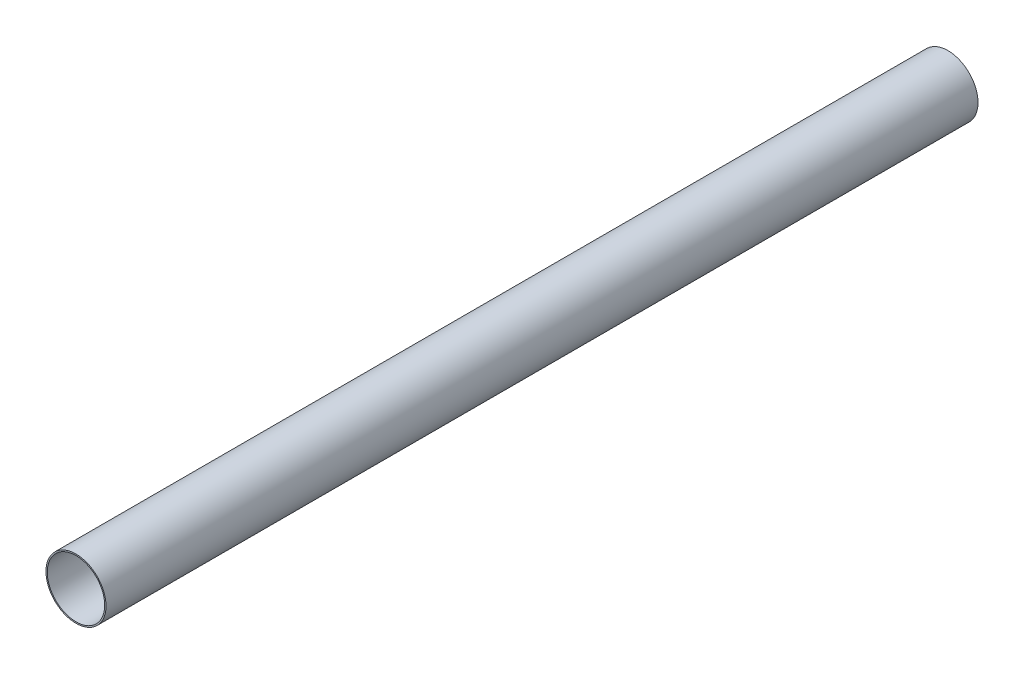
ISO-10303-21;
HEADER;
FILE_DESCRIPTION(('STEP AP214'),'2;1');
FILE_NAME('part.step','',(''),(''),'','','');
FILE_SCHEMA(('AUTOMOTIVE_DESIGN { 1 0 10303 214 1 1 1 1 }'));
ENDSEC;
DATA;
#1=APPLICATION_CONTEXT('core data for automotive mechanical design processes');
#2=APPLICATION_PROTOCOL_DEFINITION('international standard','automotive_design',2000,#1);
#3=PRODUCT_CONTEXT('',#1,'mechanical');
#4=PRODUCT('Part','Part','',(#3));
#5=PRODUCT_RELATED_PRODUCT_CATEGORY('part','',(#4));
#6=PRODUCT_DEFINITION_FORMATION('','',#4);
#7=PRODUCT_DEFINITION_CONTEXT('part definition',#1,'design');
#8=PRODUCT_DEFINITION('design','',#6,#7);
#9=PRODUCT_DEFINITION_SHAPE('','',#8);
#10=(LENGTH_UNIT() NAMED_UNIT(*) SI_UNIT(.MILLI.,.METRE.));
#11=(NAMED_UNIT(*) PLANE_ANGLE_UNIT() SI_UNIT($,.RADIAN.));
#12=(NAMED_UNIT(*) SI_UNIT($,.STERADIAN.) SOLID_ANGLE_UNIT());
#13=UNCERTAINTY_MEASURE_WITH_UNIT(LENGTH_MEASURE(1.E-05),#10,'distance_accuracy_value','');
#14=(GEOMETRIC_REPRESENTATION_CONTEXT(3) GLOBAL_UNCERTAINTY_ASSIGNED_CONTEXT((#13)) GLOBAL_UNIT_ASSIGNED_CONTEXT((#10,
#11,#12)) REPRESENTATION_CONTEXT('',''));
#15=CARTESIAN_POINT('',(0.,0.,0.));
#16=DIRECTION('',(0.,0.,1.));
#17=DIRECTION('',(1.,0.,0.));
#18=AXIS2_PLACEMENT_3D('',#15,#16,#17);
#19=CARTESIAN_POINT('',(0.,0.,460.));
#20=DIRECTION('',(0.,0.,-1.));
#21=DIRECTION('',(-1.,0.,0.));
#22=AXIS2_PLACEMENT_3D('',#19,#20,#21);
#23=CYLINDRICAL_SURFACE('',#22,15.15);
#24=CARTESIAN_POINT('',(0.,0.,460.));
#25=DIRECTION('',(0.,0.,1.));
#26=DIRECTION('',(1.,0.,0.));
#27=AXIS2_PLACEMENT_3D('',#24,#25,#26);
#28=CIRCLE('',#27,15.15);
#29=CARTESIAN_POINT('',(15.15,0.,460.));
#30=VERTEX_POINT('',#29);
#31=EDGE_CURVE('E93',#30,#30,#28,.T.);
#32=ORIENTED_EDGE('',*,*,#31,.T.);
#33=EDGE_LOOP('',(#32));
#34=FACE_BOUND('',#33,.T.);
#35=CARTESIAN_POINT('',(0.,0.,425.));
#36=DIRECTION('',(0.,0.,1.));
#37=DIRECTION('',(1.,0.,0.));
#38=AXIS2_PLACEMENT_3D('',#35,#36,#37);
#39=CIRCLE('',#38,15.15);
#40=CARTESIAN_POINT('',(15.15,0.,425.));
#41=VERTEX_POINT('',#40);
#42=EDGE_CURVE('E144',#41,#41,#39,.T.);
#43=ORIENTED_EDGE('',*,*,#42,.F.);
#44=EDGE_LOOP('',(#43));
#45=FACE_BOUND('',#44,.T.);
#46=ADVANCED_FACE('F78',(#34,#45),#23,.F.);
#47=CARTESIAN_POINT('',(0.,0.,0.));
#48=DIRECTION('',(0.,0.,1.));
#49=DIRECTION('',(1.,0.,0.));
#50=AXIS2_PLACEMENT_3D('',#47,#48,#49);
#51=CIRCLE('',#50,15.15);
#52=CARTESIAN_POINT('',(15.15,0.,0.));
#53=VERTEX_POINT('',#52);
#54=EDGE_CURVE('E96',#53,#53,#51,.T.);
#55=ORIENTED_EDGE('',*,*,#54,.F.);
#56=EDGE_LOOP('',(#55));
#57=FACE_BOUND('',#56,.T.);
#58=CARTESIAN_POINT('',(0.,0.,65.));
#59=DIRECTION('',(0.,0.,1.));
#60=DIRECTION('',(1.,0.,0.));
#61=AXIS2_PLACEMENT_3D('',#58,#59,#60);
#62=CIRCLE('',#61,15.15);
#63=CARTESIAN_POINT('',(15.15,0.,65.));
#64=VERTEX_POINT('',#63);
#65=EDGE_CURVE('E103',#64,#64,#62,.T.);
#66=ORIENTED_EDGE('',*,*,#65,.T.);
#67=EDGE_LOOP('',(#66));
#68=FACE_BOUND('',#67,.T.);
#69=ADVANCED_FACE('F119',(#57,#68),#23,.F.);
#70=CARTESIAN_POINT('',(0.,0.,460.));
#71=DIRECTION('',(0.,0.,1.));
#72=DIRECTION('',(1.,0.,0.));
#73=AXIS2_PLACEMENT_3D('',#70,#71,#72);
#74=PLANE('',#73);
#75=CARTESIAN_POINT('',(0.,0.,460.));
#76=DIRECTION('',(0.,0.,1.));
#77=DIRECTION('',(1.,0.,0.));
#78=AXIS2_PLACEMENT_3D('',#75,#76,#77);
#79=CIRCLE('',#78,15.85);
#80=CARTESIAN_POINT('',(15.85,0.,460.));
#81=VERTEX_POINT('',#80);
#82=EDGE_CURVE('E12',#81,#81,#79,.T.);
#83=ORIENTED_EDGE('',*,*,#82,.T.);
#84=EDGE_LOOP('',(#83));
#85=FACE_BOUND('',#84,.T.);
#86=ORIENTED_EDGE('',*,*,#31,.F.);
#87=EDGE_LOOP('',(#86));
#88=FACE_BOUND('',#87,.T.);
#89=ADVANCED_FACE('F126',(#85,#88),#74,.T.);
#90=CARTESIAN_POINT('',(0.,0.,0.));
#91=DIRECTION('',(0.,0.,1.));
#92=DIRECTION('',(1.,0.,0.));
#93=AXIS2_PLACEMENT_3D('',#90,#91,#92);
#94=PLANE('',#93);
#95=CARTESIAN_POINT('',(0.,0.,0.));
#96=DIRECTION('',(0.,0.,1.));
#97=DIRECTION('',(1.,0.,0.));
#98=AXIS2_PLACEMENT_3D('',#95,#96,#97);
#99=CIRCLE('',#98,15.85);
#100=CARTESIAN_POINT('',(15.85,0.,0.));
#101=VERTEX_POINT('',#100);
#102=EDGE_CURVE('E88',#101,#101,#99,.T.);
#103=ORIENTED_EDGE('',*,*,#102,.F.);
#104=EDGE_LOOP('',(#103));
#105=FACE_BOUND('',#104,.T.);
#106=ORIENTED_EDGE('',*,*,#54,.T.);
#107=EDGE_LOOP('',(#106));
#108=FACE_BOUND('',#107,.T.);
#109=ADVANCED_FACE('F216',(#105,#108),#94,.F.);
#110=CARTESIAN_POINT('',(0.,0.,460.));
#111=DIRECTION('',(0.,0.,-1.));
#112=DIRECTION('',(-1.,0.,0.));
#113=AXIS2_PLACEMENT_3D('',#110,#111,#112);
#114=CYLINDRICAL_SURFACE('',#113,15.85);
#115=ORIENTED_EDGE('',*,*,#82,.F.);
#116=EDGE_LOOP('',(#115));
#117=FACE_BOUND('',#116,.T.);
#118=ORIENTED_EDGE('',*,*,#102,.T.);
#119=EDGE_LOOP('',(#118));
#120=FACE_BOUND('',#119,.T.);
#121=ADVANCED_FACE('F80',(#117,#120),#114,.T.);
#122=CARTESIAN_POINT('',(15.15,0.,65.));
#123=CARTESIAN_POINT('',(15.2166666666667,0.,78.3333333333334));
#124=CARTESIAN_POINT('',(15.2833333333333,0.,91.6666666666667));
#125=CARTESIAN_POINT('',(15.35,0.,105.));
#126=CARTESIAN_POINT('',(15.15,0.418075620016743,65.));
#127=CARTESIAN_POINT('',(15.2166666666667,0.419915336716487,78.3333333333334));
#128=CARTESIAN_POINT('',(15.2833333333333,0.421755053416231,91.6666666666667));
#129=CARTESIAN_POINT('',(15.35,0.423594770115975,105.));
#130=CARTESIAN_POINT('',(15.1160575620017,1.24636173604689,65.));
#131=CARTESIAN_POINT('',(15.182574867005,1.2518462761395,78.3333333333334));
#132=CARTESIAN_POINT('',(15.2490921720083,1.25733081623212,91.6666666666667));
#133=CARTESIAN_POINT('',(15.3156094770116,1.26281535632473,105.));
#134=CARTESIAN_POINT('',(14.9672281881085,2.46128394098282,65.));
#135=CARTESIAN_POINT('',(15.0330905783752,2.47211467339638,78.3333333333334));
#136=CARTESIAN_POINT('',(15.0989529686419,2.48294540580995,91.6666666666667));
#137=CARTESIAN_POINT('',(15.1648153589086,2.49377613822351,105.));
#138=CARTESIAN_POINT('',(14.7243946944188,3.6447875797102,65.));
#139=CARTESIAN_POINT('',(14.7891885104558,3.66082624892785,78.3333333333334));
#140=CARTESIAN_POINT('',(14.8539823264929,3.6768649181455,91.6666666666667));
#141=CARTESIAN_POINT('',(14.9187761425299,3.69290358736314,105.));
#142=CARTESIAN_POINT('',(12.7268385960971,10.5338284322278,65.));
#143=CARTESIAN_POINT('',(12.782842286289,10.5801819126776,78.3333333333334));
#144=CARTESIAN_POINT('',(12.8388459764808,10.6265353931275,91.6666666666667));
#145=CARTESIAN_POINT('',(12.8948496666727,10.6728888735773,105.));
#146=CARTESIAN_POINT('',(6.68920992026797,15.15,65.));
#147=CARTESIAN_POINT('',(6.71864538746387,15.2166666666667,78.3333333333334));
#148=CARTESIAN_POINT('',(6.74808085465977,15.2833333333333,91.6666666666667));
#149=CARTESIAN_POINT('',(6.77751632185567,15.35,105.));
#150=CARTESIAN_POINT('',(-8.36151240033496,15.15,65.));
#151=CARTESIAN_POINT('',(-8.39830673432984,15.2166666666667,78.3333333333334));
#152=CARTESIAN_POINT('',(-8.43510106832471,15.2833333333333,91.6666666666667));
#153=CARTESIAN_POINT('',(-8.47189540231959,15.35,105.));
#154=CARTESIAN_POINT('',(-15.15,8.36151240033497,65.));
#155=CARTESIAN_POINT('',(-15.2166666666667,8.39830673432984,78.3333333333334));
#156=CARTESIAN_POINT('',(-15.2833333333333,8.43510106832472,91.6666666666667));
#157=CARTESIAN_POINT('',(-15.35,8.47189540231959,105.));
#158=CARTESIAN_POINT('',(-15.15,-8.36151240033496,65.));
#159=CARTESIAN_POINT('',(-15.2166666666667,-8.39830673432984,78.3333333333334));
#160=CARTESIAN_POINT('',(-15.2833333333333,-8.43510106832471,91.6666666666667));
#161=CARTESIAN_POINT('',(-15.35,-8.47189540231959,105.));
#162=CARTESIAN_POINT('',(-8.36151240033497,-15.15,65.));
#163=CARTESIAN_POINT('',(-8.39830673432984,-15.2166666666667,78.3333333333334));
#164=CARTESIAN_POINT('',(-8.43510106832472,-15.2833333333333,91.6666666666667));
#165=CARTESIAN_POINT('',(-8.47189540231959,-15.35,105.));
#166=CARTESIAN_POINT('',(6.68920992026797,-15.15,65.));
#167=CARTESIAN_POINT('',(6.71864538746387,-15.2166666666667,78.3333333333334));
#168=CARTESIAN_POINT('',(6.74808085465977,-15.2833333333333,91.6666666666667));
#169=CARTESIAN_POINT('',(6.77751632185567,-15.35,105.));
#170=CARTESIAN_POINT('',(12.7268385960971,-10.5338284322278,65.));
#171=CARTESIAN_POINT('',(12.782842286289,-10.5801819126776,78.3333333333334));
#172=CARTESIAN_POINT('',(12.8388459764808,-10.6265353931275,91.6666666666667));
#173=CARTESIAN_POINT('',(12.8948496666727,-10.6728888735773,105.));
#174=CARTESIAN_POINT('',(14.7243946944188,-3.64478757971021,65.));
#175=CARTESIAN_POINT('',(14.7891885104558,-3.66082624892786,78.3333333333334));
#176=CARTESIAN_POINT('',(14.8539823264929,-3.6768649181455,91.6666666666667));
#177=CARTESIAN_POINT('',(14.9187761425299,-3.69290358736315,105.));
#178=CARTESIAN_POINT('',(14.9672281881085,-2.46128394098282,65.));
#179=CARTESIAN_POINT('',(15.0330905783752,-2.47211467339639,78.3333333333334));
#180=CARTESIAN_POINT('',(15.0989529686419,-2.48294540580995,91.6666666666667));
#181=CARTESIAN_POINT('',(15.1648153589086,-2.49377613822352,105.));
#182=CARTESIAN_POINT('',(15.1160575620017,-1.2463617360469,65.));
#183=CARTESIAN_POINT('',(15.182574867005,-1.25184627613951,78.3333333333334));
#184=CARTESIAN_POINT('',(15.2490921720083,-1.25733081623213,91.6666666666667));
#185=CARTESIAN_POINT('',(15.3156094770116,-1.26281535632475,105.));
#186=CARTESIAN_POINT('',(15.15,-0.41807562001675,65.));
#187=CARTESIAN_POINT('',(15.2166666666667,-0.419915336716494,78.3333333333334));
#188=CARTESIAN_POINT('',(15.2833333333333,-0.421755053416238,91.6666666666667));
#189=CARTESIAN_POINT('',(15.35,-0.423594770115982,105.));
#190=CARTESIAN_POINT('',(15.15,0.,65.));
#191=CARTESIAN_POINT('',(15.2166666666667,0.,78.3333333333334));
#192=CARTESIAN_POINT('',(15.2833333333333,0.,91.6666666666667));
#193=CARTESIAN_POINT('',(15.35,0.,105.));
#194=B_SPLINE_SURFACE_WITH_KNOTS('',3,3,((#122,#123,#124,#125),(#126,#127,#128,#129),(#130,#131,
#132,#133),(#134,#135,#136,#137),(#138,#139,#140,#141),(#142,#143,#144,#145),(#146,#147,#148,
#149),(#150,#151,#152,#153),(#154,#155,#156,#157),(#158,#159,#160,#161),(#162,#163,#164,#165),
(#166,#167,#168,#169),(#170,#171,#172,#173),(#174,#175,#176,#177),(#178,#179,#180,#181),(#182,
#183,#184,#185),(#186,#187,#188,#189),(#190,#191,#192,#193)),.UNSPECIFIED.,.T.,.F.,.F.,(4,1,1,1,
1,2,2,2,1,1,1,1,4),(4,4),(0.,0.0125,0.0249999999999999,0.0375000000000001,0.05,0.25,0.5,0.75,
0.95,0.9625,0.975,0.9875,1.),(0.,1.),.UNSPECIFIED.);
#195=CARTESIAN_POINT('',(0.,0.,105.));
#196=DIRECTION('',(0.,0.,1.));
#197=DIRECTION('',(1.,0.,0.));
#198=AXIS2_PLACEMENT_3D('',#195,#196,#197);
#199=CIRCLE('',#198,15.35);
#200=CARTESIAN_POINT('',(15.35,0.,105.));
#201=VERTEX_POINT('',#200);
#202=EDGE_CURVE('E142',#201,#201,#199,.T.);
#203=CARTESIAN_POINT('',(15.15,0.,65.));
#204=CARTESIAN_POINT('',(15.1520833333333,0.,65.4166666666667));
#205=CARTESIAN_POINT('',(15.1541666666667,0.,65.8333333333333));
#206=CARTESIAN_POINT('',(15.1583333333333,0.,66.6666666666667));
#207=CARTESIAN_POINT('',(15.1604166666667,0.,67.0833333333333));
#208=CARTESIAN_POINT('',(15.1645833333333,0.,67.9166666666667));
#209=CARTESIAN_POINT('',(15.1666666666667,0.,68.3333333333333));
#210=CARTESIAN_POINT('',(15.1708333333333,0.,69.1666666666667));
#211=CARTESIAN_POINT('',(15.1729166666667,0.,69.5833333333333));
#212=CARTESIAN_POINT('',(15.1770833333333,0.,70.4166666666667));
#213=CARTESIAN_POINT('',(15.1791666666667,0.,70.8333333333333));
#214=CARTESIAN_POINT('',(15.1833333333333,0.,71.6666666666667));
#215=CARTESIAN_POINT('',(15.1854166666667,0.,72.0833333333333));
#216=CARTESIAN_POINT('',(15.1895833333333,0.,72.9166666666667));
#217=CARTESIAN_POINT('',(15.1916666666667,0.,73.3333333333333));
#218=CARTESIAN_POINT('',(15.1958333333333,0.,74.1666666666667));
#219=CARTESIAN_POINT('',(15.1979166666667,0.,74.5833333333333));
#220=CARTESIAN_POINT('',(15.2020833333333,0.,75.4166666666667));
#221=CARTESIAN_POINT('',(15.2041666666667,0.,75.8333333333333));
#222=CARTESIAN_POINT('',(15.2083333333333,0.,76.6666666666667));
#223=CARTESIAN_POINT('',(15.2104166666667,0.,77.0833333333334));
#224=CARTESIAN_POINT('',(15.2145833333333,0.,77.9166666666667));
#225=CARTESIAN_POINT('',(15.2166666666667,0.,78.3333333333334));
#226=CARTESIAN_POINT('',(15.2208333333333,0.,79.1666666666667));
#227=CARTESIAN_POINT('',(15.2229166666667,0.,79.5833333333334));
#228=CARTESIAN_POINT('',(15.2270833333333,0.,80.4166666666667));
#229=CARTESIAN_POINT('',(15.2291666666667,0.,80.8333333333334));
#230=CARTESIAN_POINT('',(15.2333333333333,0.,81.6666666666667));
#231=CARTESIAN_POINT('',(15.2354166666667,0.,82.0833333333334));
#232=CARTESIAN_POINT('',(15.2395833333333,0.,82.9166666666667));
#233=CARTESIAN_POINT('',(15.2416666666667,0.,83.3333333333334));
#234=CARTESIAN_POINT('',(15.2458333333333,0.,84.1666666666667));
#235=CARTESIAN_POINT('',(15.2479166666667,0.,84.5833333333334));
#236=CARTESIAN_POINT('',(15.2520833333333,0.,85.4166666666667));
#237=CARTESIAN_POINT('',(15.2541666666667,0.,85.8333333333334));
#238=CARTESIAN_POINT('',(15.2583333333333,0.,86.6666666666667));
#239=CARTESIAN_POINT('',(15.2604166666667,0.,87.0833333333334));
#240=CARTESIAN_POINT('',(15.2645833333333,0.,87.9166666666667));
#241=CARTESIAN_POINT('',(15.2666666666667,0.,88.3333333333333));
#242=CARTESIAN_POINT('',(15.2708333333333,0.,89.1666666666667));
#243=CARTESIAN_POINT('',(15.2729166666667,0.,89.5833333333333));
#244=CARTESIAN_POINT('',(15.2770833333333,0.,90.4166666666667));
#245=CARTESIAN_POINT('',(15.2791666666667,0.,90.8333333333333));
#246=CARTESIAN_POINT('',(15.2833333333333,0.,91.6666666666667));
#247=CARTESIAN_POINT('',(15.2854166666667,0.,92.0833333333334));
#248=CARTESIAN_POINT('',(15.2895833333333,0.,92.9166666666667));
#249=CARTESIAN_POINT('',(15.2916666666667,0.,93.3333333333334));
#250=CARTESIAN_POINT('',(15.2958333333333,0.,94.1666666666667));
#251=CARTESIAN_POINT('',(15.2979166666667,0.,94.5833333333334));
#252=CARTESIAN_POINT('',(15.3020833333333,0.,95.4166666666667));
#253=CARTESIAN_POINT('',(15.3041666666667,0.,95.8333333333334));
#254=CARTESIAN_POINT('',(15.3083333333333,0.,96.6666666666667));
#255=CARTESIAN_POINT('',(15.3104166666667,0.,97.0833333333334));
#256=CARTESIAN_POINT('',(15.3145833333333,0.,97.9166666666667));
#257=CARTESIAN_POINT('',(15.3166666666667,0.,98.3333333333334));
#258=CARTESIAN_POINT('',(15.3208333333333,0.,99.1666666666667));
#259=CARTESIAN_POINT('',(15.3229166666667,0.,99.5833333333334));
#260=CARTESIAN_POINT('',(15.3270833333333,0.,100.416666666667));
#261=CARTESIAN_POINT('',(15.3291666666667,0.,100.833333333333));
#262=CARTESIAN_POINT('',(15.3333333333333,0.,101.666666666667));
#263=CARTESIAN_POINT('',(15.3354166666667,0.,102.083333333333));
#264=CARTESIAN_POINT('',(15.3395833333333,0.,102.916666666667));
#265=CARTESIAN_POINT('',(15.3416666666667,0.,103.333333333333));
#266=CARTESIAN_POINT('',(15.3458333333333,0.,104.166666666667));
#267=CARTESIAN_POINT('',(15.3479166666667,0.,104.583333333333));
#268=CARTESIAN_POINT('',(15.35,0.,105.));
#269=B_SPLINE_CURVE_WITH_KNOTS('',3,(#203,#204,#205,#206,#207,#208,#209,#210,#211,#212,#213,
#214,#215,#216,#217,#218,#219,#220,#221,#222,#223,#224,#225,#226,#227,#228,#229,#230,#231,#232,
#233,#234,#235,#236,#237,#238,#239,#240,#241,#242,#243,#244,#245,#246,#247,#248,#249,#250,#251,
#252,#253,#254,#255,#256,#257,#258,#259,#260,#261,#262,#263,#264,#265,#266,#267,#268),
.UNSPECIFIED.,.F.,.F.,(4,2,2,2,2,2,2,2,2,2,2,2,2,2,2,2,2,2,2,2,2,2,2,2,2,2,2,2,2,2,2,2,4),(0.,
1.25001562490233,2.50003124980471,3.75004687470704,5.00006249960937,6.25007812451173,
7.50009374941408,8.75010937431641,10.0001249992188,11.2501406241211,12.5001562490235,
13.7501718739258,15.0001874988282,16.2502031237305,17.5002187486328,18.7502343735352,
20.0002499984375,21.2502656233399,22.5002812482422,23.7502968731446,25.0003124980469,
26.2503281229493,27.5003437478516,28.7503593727539,30.0003749976563,31.2503906225586,
32.500406247461,33.7504218723633,35.0004374972657,36.250453122168,37.5004687470704,
38.7504843719727,40.000499996875),.UNSPECIFIED.);
#270=EDGE_CURVE('BSEAM121',#64,#201,#269,.T.);
#271=ORIENTED_EDGE('',*,*,#65,.F.);
#272=ORIENTED_EDGE('',*,*,#202,.T.);
#273=ORIENTED_EDGE('',*,*,#270,.T.);
#274=ORIENTED_EDGE('',*,*,#270,.F.);
#275=EDGE_LOOP('',(#271,#273,#272,#274));
#276=FACE_BOUND('',#275,.T.);
#277=ADVANCED_FACE('F121',(#276),#194,.F.);
#278=CARTESIAN_POINT('',(15.15,0.,425.));
#279=CARTESIAN_POINT('',(15.2166666666667,0.,411.666666666667));
#280=CARTESIAN_POINT('',(15.2833333333333,0.,398.333333333333));
#281=CARTESIAN_POINT('',(15.35,0.,385.));
#282=CARTESIAN_POINT('',(15.15,-0.41807562001675,425.));
#283=CARTESIAN_POINT('',(15.2166666666667,-0.419915336716494,411.666666666667));
#284=CARTESIAN_POINT('',(15.2833333333333,-0.421755053416238,398.333333333333));
#285=CARTESIAN_POINT('',(15.35,-0.423594770115982,385.));
#286=CARTESIAN_POINT('',(15.1160575620017,-1.24636173604689,425.));
#287=CARTESIAN_POINT('',(15.182574867005,-1.25184627613951,411.666666666667));
#288=CARTESIAN_POINT('',(15.2490921720083,-1.25733081623213,398.333333333333));
#289=CARTESIAN_POINT('',(15.3156094770116,-1.26281535632474,385.));
#290=CARTESIAN_POINT('',(14.9672281881085,-2.46128394098282,425.));
#291=CARTESIAN_POINT('',(15.0330905783752,-2.47211467339639,411.666666666667));
#292=CARTESIAN_POINT('',(15.0989529686419,-2.48294540580995,398.333333333333));
#293=CARTESIAN_POINT('',(15.1648153589086,-2.49377613822352,385.));
#294=CARTESIAN_POINT('',(14.7243946944188,-3.64478757971021,425.));
#295=CARTESIAN_POINT('',(14.7891885104558,-3.66082624892786,411.666666666667));
#296=CARTESIAN_POINT('',(14.8539823264928,-3.6768649181455,398.333333333333));
#297=CARTESIAN_POINT('',(14.9187761425299,-3.69290358736315,385.));
#298=CARTESIAN_POINT('',(12.7268385960971,-10.5338284322278,425.));
#299=CARTESIAN_POINT('',(12.782842286289,-10.5801819126776,411.666666666667));
#300=CARTESIAN_POINT('',(12.8388459764808,-10.6265353931275,398.333333333333));
#301=CARTESIAN_POINT('',(12.8948496666727,-10.6728888735773,385.));
#302=CARTESIAN_POINT('',(6.68920992026797,-15.15,425.));
#303=CARTESIAN_POINT('',(6.71864538746387,-15.2166666666667,411.666666666667));
#304=CARTESIAN_POINT('',(6.74808085465977,-15.2833333333333,398.333333333333));
#305=CARTESIAN_POINT('',(6.77751632185567,-15.35,385.));
#306=CARTESIAN_POINT('',(-8.36151240033497,-15.15,425.));
#307=CARTESIAN_POINT('',(-8.39830673432984,-15.2166666666667,411.666666666667));
#308=CARTESIAN_POINT('',(-8.43510106832472,-15.2833333333333,398.333333333333));
#309=CARTESIAN_POINT('',(-8.47189540231959,-15.35,385.));
#310=CARTESIAN_POINT('',(-15.15,-8.36151240033496,425.));
#311=CARTESIAN_POINT('',(-15.2166666666667,-8.39830673432984,411.666666666667));
#312=CARTESIAN_POINT('',(-15.2833333333333,-8.43510106832471,398.333333333333));
#313=CARTESIAN_POINT('',(-15.35,-8.47189540231959,385.));
#314=CARTESIAN_POINT('',(-15.15,8.36151240033497,425.));
#315=CARTESIAN_POINT('',(-15.2166666666667,8.39830673432984,411.666666666667));
#316=CARTESIAN_POINT('',(-15.2833333333333,8.43510106832472,398.333333333333));
#317=CARTESIAN_POINT('',(-15.35,8.47189540231959,385.));
#318=CARTESIAN_POINT('',(-8.36151240033496,15.15,425.));
#319=CARTESIAN_POINT('',(-8.39830673432984,15.2166666666667,411.666666666667));
#320=CARTESIAN_POINT('',(-8.43510106832471,15.2833333333333,398.333333333333));
#321=CARTESIAN_POINT('',(-8.47189540231959,15.35,385.));
#322=CARTESIAN_POINT('',(6.68920992026797,15.15,425.));
#323=CARTESIAN_POINT('',(6.71864538746387,15.2166666666667,411.666666666667));
#324=CARTESIAN_POINT('',(6.74808085465977,15.2833333333333,398.333333333333));
#325=CARTESIAN_POINT('',(6.77751632185567,15.35,385.));
#326=CARTESIAN_POINT('',(12.7268385960971,10.5338284322278,425.));
#327=CARTESIAN_POINT('',(12.782842286289,10.5801819126776,411.666666666667));
#328=CARTESIAN_POINT('',(12.8388459764808,10.6265353931275,398.333333333333));
#329=CARTESIAN_POINT('',(12.8948496666727,10.6728888735773,385.));
#330=CARTESIAN_POINT('',(14.7243946944188,3.6447875797102,425.));
#331=CARTESIAN_POINT('',(14.7891885104558,3.66082624892785,411.666666666667));
#332=CARTESIAN_POINT('',(14.8539823264929,3.6768649181455,398.333333333333));
#333=CARTESIAN_POINT('',(14.9187761425299,3.69290358736314,385.));
#334=CARTESIAN_POINT('',(14.9672281881085,2.46128394098282,425.));
#335=CARTESIAN_POINT('',(15.0330905783752,2.47211467339638,411.666666666667));
#336=CARTESIAN_POINT('',(15.0989529686419,2.48294540580995,398.333333333333));
#337=CARTESIAN_POINT('',(15.1648153589086,2.49377613822351,385.));
#338=CARTESIAN_POINT('',(15.1160575620017,1.24636173604689,425.));
#339=CARTESIAN_POINT('',(15.182574867005,1.25184627613951,411.666666666667));
#340=CARTESIAN_POINT('',(15.2490921720083,1.25733081623212,398.333333333333));
#341=CARTESIAN_POINT('',(15.3156094770116,1.26281535632474,385.));
#342=CARTESIAN_POINT('',(15.15,0.418075620016744,425.));
#343=CARTESIAN_POINT('',(15.2166666666667,0.419915336716487,411.666666666667));
#344=CARTESIAN_POINT('',(15.2833333333333,0.421755053416231,398.333333333333));
#345=CARTESIAN_POINT('',(15.35,0.423594770115974,385.));
#346=CARTESIAN_POINT('',(15.15,0.,425.));
#347=CARTESIAN_POINT('',(15.2166666666667,0.,411.666666666667));
#348=CARTESIAN_POINT('',(15.2833333333333,0.,398.333333333333));
#349=CARTESIAN_POINT('',(15.35,0.,385.));
#350=B_SPLINE_SURFACE_WITH_KNOTS('',3,3,((#278,#279,#280,#281),(#282,#283,#284,#285),(#286,#287,
#288,#289),(#290,#291,#292,#293),(#294,#295,#296,#297),(#298,#299,#300,#301),(#302,#303,#304,
#305),(#306,#307,#308,#309),(#310,#311,#312,#313),(#314,#315,#316,#317),(#318,#319,#320,#321),
(#322,#323,#324,#325),(#326,#327,#328,#329),(#330,#331,#332,#333),(#334,#335,#336,#337),(#338,
#339,#340,#341),(#342,#343,#344,#345),(#346,#347,#348,#349)),.UNSPECIFIED.,.T.,.F.,.F.,(4,1,1,1,
1,2,2,2,1,1,1,1,4),(4,4),(0.,0.0125,0.0249999999999999,0.0375000000000001,0.05,0.25,0.5,0.75,
0.95,0.9625,0.975,0.9875,1.),(0.,1.),.UNSPECIFIED.);
#351=CARTESIAN_POINT('',(15.35,0.,385.));
#352=CARTESIAN_POINT('',(15.35,-0.423594770115982,385.));
#353=CARTESIAN_POINT('',(15.3156094770116,-1.26281535632474,385.));
#354=CARTESIAN_POINT('',(15.1648153589086,-2.49377613822352,385.));
#355=CARTESIAN_POINT('',(14.9187761425299,-3.69290358736315,385.));
#356=CARTESIAN_POINT('',(12.8948496666727,-10.6728888735773,385.));
#357=CARTESIAN_POINT('',(6.77751632185567,-15.35,385.));
#358=CARTESIAN_POINT('',(-8.47189540231959,-15.35,385.));
#359=CARTESIAN_POINT('',(-15.35,-8.47189540231959,385.));
#360=CARTESIAN_POINT('',(-15.35,8.47189540231959,385.));
#361=CARTESIAN_POINT('',(-8.47189540231959,15.35,385.));
#362=CARTESIAN_POINT('',(6.77751632185567,15.35,385.));
#363=CARTESIAN_POINT('',(12.8948496666727,10.6728888735773,385.));
#364=CARTESIAN_POINT('',(14.9187761425299,3.69290358736314,385.));
#365=CARTESIAN_POINT('',(15.1648153589086,2.49377613822351,385.));
#366=CARTESIAN_POINT('',(15.3156094770116,1.26281535632474,385.));
#367=CARTESIAN_POINT('',(15.35,0.423594770115974,385.));
#368=CARTESIAN_POINT('',(15.35,0.,385.));
#369=B_SPLINE_CURVE_WITH_KNOTS('',3,(#351,#352,#353,#354,#355,#356,#357,#358,#359,#360,#361,
#362,#363,#364,#365,#366,#367,#368),.UNSPECIFIED.,.T.,.F.,(4,1,1,1,1,2,2,2,1,1,1,1,4),(0.,
0.0125,0.0249999999999999,0.0375000000000001,0.05,0.25,0.5,0.75,0.95,0.9625,0.975,0.9875,1.),.UNSPECIFIED.);
#370=CARTESIAN_POINT('',(15.35,0.,385.));
#371=VERTEX_POINT('',#370);
#372=EDGE_CURVE('E138',#371,#371,#369,.F.);
#373=ORIENTED_EDGE('',*,*,#42,.T.);
#374=EDGE_LOOP('',(#373));
#375=FACE_BOUND('',#374,.T.);
#376=ORIENTED_EDGE('',*,*,#372,.F.);
#377=EDGE_LOOP('',(#376));
#378=FACE_BOUND('',#377,.T.);
#379=ADVANCED_FACE('F161',(#375,#378),#350,.F.);
#380=CARTESIAN_POINT('',(0.,0.,-0.000999999999973245));
#381=DIRECTION('',(0.,0.,1.));
#382=DIRECTION('',(1.,0.,0.));
#383=AXIS2_PLACEMENT_3D('',#380,#381,#382);
#384=CYLINDRICAL_SURFACE('',#383,15.35);
#385=ORIENTED_EDGE('',*,*,#202,.F.);
#386=EDGE_LOOP('',(#385));
#387=FACE_BOUND('',#386,.T.);
#388=ORIENTED_EDGE('',*,*,#372,.T.);
#389=EDGE_LOOP('',(#388));
#390=FACE_BOUND('',#389,.T.);
#391=ADVANCED_FACE('F139',(#387,#390),#384,.F.);
#392=CLOSED_SHELL('',(#46,#69,#89,#109,#121,#277,#379,#391));
#393=MANIFOLD_SOLID_BREP('B2',#392);
#394=ADVANCED_BREP_SHAPE_REPRESENTATION('',(#18,#393),#14);
#395=SHAPE_DEFINITION_REPRESENTATION(#9,#394);
ENDSEC;
END-ISO-10303-21;
